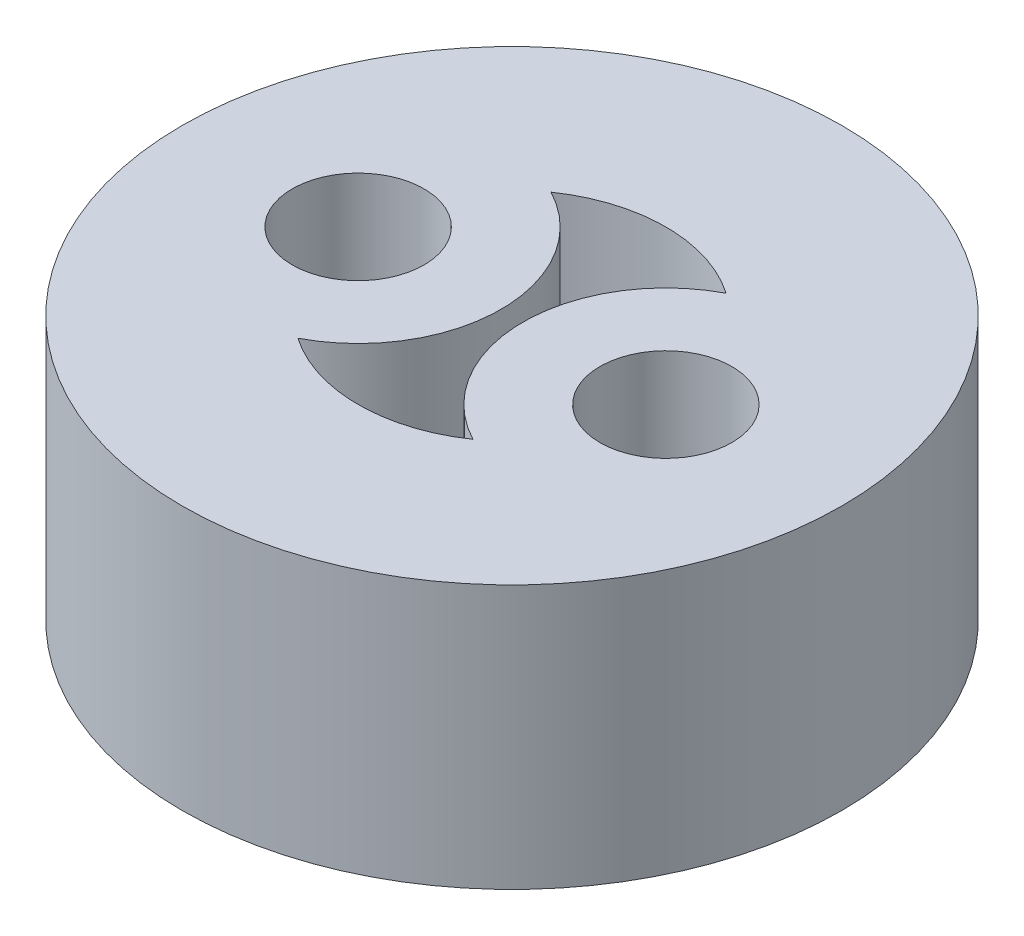
ISO-10303-21;
HEADER;
FILE_DESCRIPTION(('STEP AP214'),'2;1');
FILE_NAME('part.step','',(''),(''),'','','');
FILE_SCHEMA(('AUTOMOTIVE_DESIGN { 1 0 10303 214 1 1 1 1 }'));
ENDSEC;
DATA;
#1=APPLICATION_CONTEXT('core data for automotive mechanical design processes');
#2=APPLICATION_PROTOCOL_DEFINITION('international standard','automotive_design',2000,#1);
#3=PRODUCT_CONTEXT('',#1,'mechanical');
#4=PRODUCT('Part','Part','',(#3));
#5=PRODUCT_RELATED_PRODUCT_CATEGORY('part','',(#4));
#6=PRODUCT_DEFINITION_FORMATION('','',#4);
#7=PRODUCT_DEFINITION_CONTEXT('part definition',#1,'design');
#8=PRODUCT_DEFINITION('design','',#6,#7);
#9=PRODUCT_DEFINITION_SHAPE('','',#8);
#10=(LENGTH_UNIT() NAMED_UNIT(*) SI_UNIT(.MILLI.,.METRE.));
#11=(NAMED_UNIT(*) PLANE_ANGLE_UNIT() SI_UNIT($,.RADIAN.));
#12=(NAMED_UNIT(*) SI_UNIT($,.STERADIAN.) SOLID_ANGLE_UNIT());
#13=UNCERTAINTY_MEASURE_WITH_UNIT(LENGTH_MEASURE(1.E-05),#10,'distance_accuracy_value','');
#14=(GEOMETRIC_REPRESENTATION_CONTEXT(3) GLOBAL_UNCERTAINTY_ASSIGNED_CONTEXT((#13)) GLOBAL_UNIT_ASSIGNED_CONTEXT((#10,
#11,#12)) REPRESENTATION_CONTEXT('',''));
#15=CARTESIAN_POINT('',(0.,0.,0.));
#16=DIRECTION('',(0.,0.,1.));
#17=DIRECTION('',(1.,0.,0.));
#18=AXIS2_PLACEMENT_3D('',#15,#16,#17);
#19=CARTESIAN_POINT('',(0.,6.,0.));
#20=DIRECTION('',(0.,1.,0.));
#21=DIRECTION('',(0.,0.,1.));
#22=AXIS2_PLACEMENT_3D('',#19,#20,#21);
#23=PLANE('',#22);
#24=CARTESIAN_POINT('',(-3.5,6.,0.));
#25=DIRECTION('',(0.,1.,0.));
#26=DIRECTION('',(0.,0.,1.));
#27=AXIS2_PLACEMENT_3D('',#24,#25,#26);
#28=CIRCLE('',#27,1.5);
#29=CARTESIAN_POINT('',(-3.5,6.,1.5));
#30=VERTEX_POINT('',#29);
#31=EDGE_CURVE('E115',#30,#30,#28,.T.);
#32=ORIENTED_EDGE('',*,*,#31,.F.);
#33=EDGE_LOOP('',(#32));
#34=FACE_BOUND('',#33,.T.);
#35=CARTESIAN_POINT('',(0.,6.,0.));
#36=DIRECTION('',(0.,1.,0.));
#37=DIRECTION('',(0.,0.,1.));
#38=AXIS2_PLACEMENT_3D('',#35,#36,#37);
#39=CIRCLE('',#38,7.5);
#40=CARTESIAN_POINT('',(0.,6.,7.5));
#41=VERTEX_POINT('',#40);
#42=EDGE_CURVE('E11',#41,#41,#39,.T.);
#43=ORIENTED_EDGE('',*,*,#42,.T.);
#44=EDGE_LOOP('',(#43));
#45=FACE_BOUND('',#44,.T.);
#46=CARTESIAN_POINT('',(3.5,6.,0.));
#47=DIRECTION('',(0.,1.,0.));
#48=DIRECTION('',(0.,0.,1.));
#49=AXIS2_PLACEMENT_3D('',#46,#47,#48);
#50=CIRCLE('',#49,1.5);
#51=CARTESIAN_POINT('',(3.5,6.,1.5));
#52=VERTEX_POINT('',#51);
#53=EDGE_CURVE('E109',#52,#52,#50,.T.);
#54=ORIENTED_EDGE('',*,*,#53,.F.);
#55=EDGE_LOOP('',(#54));
#56=FACE_BOUND('',#55,.T.);
#57=CARTESIAN_POINT('',(-3.5,6.,0.));
#58=DIRECTION('',(0.,-1.,0.));
#59=DIRECTION('',(0.,0.,1.));
#60=AXIS2_PLACEMENT_3D('',#57,#58,#59);
#61=CIRCLE('',#60,3.25);
#62=CARTESIAN_POINT('',(-1.99107142857143,6.,-2.87847782105865));
#63=VERTEX_POINT('',#62);
#64=CARTESIAN_POINT('',(-1.99107142857143,6.,2.87847782105865));
#65=VERTEX_POINT('',#64);
#66=EDGE_CURVE('E81',#63,#65,#61,.T.);
#67=ORIENTED_EDGE('',*,*,#66,.F.);
#68=CARTESIAN_POINT('',(0.,6.,0.));
#69=DIRECTION('',(0.,1.,0.));
#70=DIRECTION('',(0.,0.,1.));
#71=AXIS2_PLACEMENT_3D('',#68,#69,#70);
#72=CIRCLE('',#71,3.5);
#73=CARTESIAN_POINT('',(1.99107142857143,6.,-2.87847782105865));
#74=VERTEX_POINT('',#73);
#75=EDGE_CURVE('E73',#74,#63,#72,.T.);
#76=ORIENTED_EDGE('',*,*,#75,.F.);
#77=CARTESIAN_POINT('',(3.5,6.,0.));
#78=DIRECTION('',(0.,-1.,0.));
#79=DIRECTION('',(0.,0.,1.));
#80=AXIS2_PLACEMENT_3D('',#77,#78,#79);
#81=CIRCLE('',#80,3.25);
#82=CARTESIAN_POINT('',(1.99107142857143,6.,2.87847782105865));
#83=VERTEX_POINT('',#82);
#84=EDGE_CURVE('E95',#83,#74,#81,.T.);
#85=ORIENTED_EDGE('',*,*,#84,.F.);
#86=CARTESIAN_POINT('',(0.,6.,0.));
#87=DIRECTION('',(0.,1.,0.));
#88=DIRECTION('',(0.,0.,1.));
#89=AXIS2_PLACEMENT_3D('',#86,#87,#88);
#90=CIRCLE('',#89,3.5);
#91=EDGE_CURVE('E93',#65,#83,#90,.T.);
#92=ORIENTED_EDGE('',*,*,#91,.F.);
#93=EDGE_LOOP('',(#67,#76,#85,#92));
#94=FACE_BOUND('',#93,.T.);
#95=ADVANCED_FACE('F32',(#34,#45,#56,#94),#23,.T.);
#96=CARTESIAN_POINT('',(0.,0.,0.));
#97=DIRECTION('',(0.,1.,0.));
#98=DIRECTION('',(0.,0.,1.));
#99=AXIS2_PLACEMENT_3D('',#96,#97,#98);
#100=PLANE('',#99);
#101=CARTESIAN_POINT('',(3.5,0.,0.));
#102=DIRECTION('',(0.,1.,0.));
#103=DIRECTION('',(0.,0.,1.));
#104=AXIS2_PLACEMENT_3D('',#101,#102,#103);
#105=CIRCLE('',#104,1.5);
#106=CARTESIAN_POINT('',(3.5,0.,1.5));
#107=VERTEX_POINT('',#106);
#108=EDGE_CURVE('E89',#107,#107,#105,.T.);
#109=ORIENTED_EDGE('',*,*,#108,.T.);
#110=EDGE_LOOP('',(#109));
#111=FACE_BOUND('',#110,.T.);
#112=CARTESIAN_POINT('',(-3.5,0.,0.));
#113=DIRECTION('',(0.,1.,0.));
#114=DIRECTION('',(0.,0.,1.));
#115=AXIS2_PLACEMENT_3D('',#112,#113,#114);
#116=CIRCLE('',#115,1.5);
#117=CARTESIAN_POINT('',(-3.5,0.,1.5));
#118=VERTEX_POINT('',#117);
#119=EDGE_CURVE('E112',#118,#118,#116,.T.);
#120=ORIENTED_EDGE('',*,*,#119,.T.);
#121=EDGE_LOOP('',(#120));
#122=FACE_BOUND('',#121,.T.);
#123=CARTESIAN_POINT('',(0.,0.,0.));
#124=DIRECTION('',(0.,1.,0.));
#125=DIRECTION('',(0.,0.,1.));
#126=AXIS2_PLACEMENT_3D('',#123,#124,#125);
#127=CIRCLE('',#126,7.5);
#128=CARTESIAN_POINT('',(0.,0.,7.5));
#129=VERTEX_POINT('',#128);
#130=EDGE_CURVE('E36',#129,#129,#127,.T.);
#131=ORIENTED_EDGE('',*,*,#130,.F.);
#132=EDGE_LOOP('',(#131));
#133=FACE_BOUND('',#132,.T.);
#134=CARTESIAN_POINT('',(0.,0.,0.));
#135=DIRECTION('',(0.,1.,0.));
#136=DIRECTION('',(0.,0.,1.));
#137=AXIS2_PLACEMENT_3D('',#134,#135,#136);
#138=CIRCLE('',#137,3.5);
#139=CARTESIAN_POINT('',(1.99107142857143,0.,-2.87847782105865));
#140=VERTEX_POINT('',#139);
#141=CARTESIAN_POINT('',(-1.99107142857143,0.,-2.87847782105865));
#142=VERTEX_POINT('',#141);
#143=EDGE_CURVE('E55',#140,#142,#138,.T.);
#144=ORIENTED_EDGE('',*,*,#143,.T.);
#145=CARTESIAN_POINT('',(-3.5,0.,0.));
#146=DIRECTION('',(0.,-1.,0.));
#147=DIRECTION('',(0.,0.,1.));
#148=AXIS2_PLACEMENT_3D('',#145,#146,#147);
#149=CIRCLE('',#148,3.25);
#150=CARTESIAN_POINT('',(-1.99107142857143,0.,2.87847782105865));
#151=VERTEX_POINT('',#150);
#152=EDGE_CURVE('E88',#142,#151,#149,.T.);
#153=ORIENTED_EDGE('',*,*,#152,.T.);
#154=CARTESIAN_POINT('',(0.,0.,0.));
#155=DIRECTION('',(0.,1.,0.));
#156=DIRECTION('',(0.,0.,1.));
#157=AXIS2_PLACEMENT_3D('',#154,#155,#156);
#158=CIRCLE('',#157,3.5);
#159=CARTESIAN_POINT('',(1.99107142857143,0.,2.87847782105865));
#160=VERTEX_POINT('',#159);
#161=EDGE_CURVE('E101',#151,#160,#158,.T.);
#162=ORIENTED_EDGE('',*,*,#161,.T.);
#163=CARTESIAN_POINT('',(3.5,0.,0.));
#164=DIRECTION('',(0.,-1.,0.));
#165=DIRECTION('',(0.,0.,1.));
#166=AXIS2_PLACEMENT_3D('',#163,#164,#165);
#167=CIRCLE('',#166,3.25);
#168=EDGE_CURVE('E82',#160,#140,#167,.T.);
#169=ORIENTED_EDGE('',*,*,#168,.T.);
#170=EDGE_LOOP('',(#144,#153,#162,#169));
#171=FACE_BOUND('',#170,.T.);
#172=ADVANCED_FACE('F121',(#111,#122,#133,#171),#100,.F.);
#173=CARTESIAN_POINT('',(0.,6.,0.));
#174=DIRECTION('',(0.,-1.,0.));
#175=DIRECTION('',(0.,0.,-1.));
#176=AXIS2_PLACEMENT_3D('',#173,#174,#175);
#177=CYLINDRICAL_SURFACE('',#176,7.5);
#178=ORIENTED_EDGE('',*,*,#42,.F.);
#179=EDGE_LOOP('',(#178));
#180=FACE_BOUND('',#179,.T.);
#181=ORIENTED_EDGE('',*,*,#130,.T.);
#182=EDGE_LOOP('',(#181));
#183=FACE_BOUND('',#182,.T.);
#184=ADVANCED_FACE('F34',(#180,#183),#177,.T.);
#185=CARTESIAN_POINT('',(-3.5,6.,0.));
#186=DIRECTION('',(0.,-1.,0.));
#187=DIRECTION('',(0.,0.,-1.));
#188=AXIS2_PLACEMENT_3D('',#185,#186,#187);
#189=CYLINDRICAL_SURFACE('',#188,1.5);
#190=ORIENTED_EDGE('',*,*,#31,.T.);
#191=EDGE_LOOP('',(#190));
#192=FACE_BOUND('',#191,.T.);
#193=ORIENTED_EDGE('',*,*,#119,.F.);
#194=EDGE_LOOP('',(#193));
#195=FACE_BOUND('',#194,.T.);
#196=ADVANCED_FACE('F124',(#192,#195),#189,.F.);
#197=CARTESIAN_POINT('',(3.5,6.,0.));
#198=DIRECTION('',(0.,-1.,0.));
#199=DIRECTION('',(0.,0.,-1.));
#200=AXIS2_PLACEMENT_3D('',#197,#198,#199);
#201=CYLINDRICAL_SURFACE('',#200,1.5);
#202=ORIENTED_EDGE('',*,*,#53,.T.);
#203=EDGE_LOOP('',(#202));
#204=FACE_BOUND('',#203,.T.);
#205=ORIENTED_EDGE('',*,*,#108,.F.);
#206=EDGE_LOOP('',(#205));
#207=FACE_BOUND('',#206,.T.);
#208=ADVANCED_FACE('F126',(#204,#207),#201,.F.);
#209=CARTESIAN_POINT('',(0.,6.,0.));
#210=DIRECTION('',(0.,-1.,0.));
#211=DIRECTION('',(0.,0.,-1.));
#212=AXIS2_PLACEMENT_3D('',#209,#210,#211);
#213=CYLINDRICAL_SURFACE('',#212,3.5);
#214=ORIENTED_EDGE('',*,*,#143,.F.);
#215=DIRECTION('',(0.,-1.,0.));
#216=VECTOR('',#215,1.);
#217=CARTESIAN_POINT('',(1.99107142857143,6.,-2.87847782105865));
#218=LINE('',#217,#216);
#219=EDGE_CURVE('E77',#74,#140,#218,.T.);
#220=ORIENTED_EDGE('',*,*,#219,.F.);
#221=ORIENTED_EDGE('',*,*,#75,.T.);
#222=DIRECTION('',(0.,-1.,0.));
#223=VECTOR('',#222,1.);
#224=CARTESIAN_POINT('',(-1.99107142857143,6.,-2.87847782105865));
#225=LINE('',#224,#223);
#226=EDGE_CURVE('E76',#63,#142,#225,.T.);
#227=ORIENTED_EDGE('',*,*,#226,.T.);
#228=EDGE_LOOP('',(#214,#220,#221,#227));
#229=FACE_BOUND('',#228,.T.);
#230=ADVANCED_FACE('F75',(#229),#213,.F.);
#231=CARTESIAN_POINT('',(-3.5,6.,0.));
#232=DIRECTION('',(0.,-1.,0.));
#233=DIRECTION('',(0.,0.,-1.));
#234=AXIS2_PLACEMENT_3D('',#231,#232,#233);
#235=CYLINDRICAL_SURFACE('',#234,3.25);
#236=ORIENTED_EDGE('',*,*,#152,.F.);
#237=ORIENTED_EDGE('',*,*,#226,.F.);
#238=ORIENTED_EDGE('',*,*,#66,.T.);
#239=DIRECTION('',(0.,-1.,0.));
#240=VECTOR('',#239,1.);
#241=CARTESIAN_POINT('',(-1.99107142857143,6.,2.87847782105865));
#242=LINE('',#241,#240);
#243=EDGE_CURVE('E90',#65,#151,#242,.T.);
#244=ORIENTED_EDGE('',*,*,#243,.T.);
#245=EDGE_LOOP('',(#236,#237,#238,#244));
#246=FACE_BOUND('',#245,.T.);
#247=ADVANCED_FACE('F85',(#246),#235,.T.);
#248=CARTESIAN_POINT('',(0.,6.,0.));
#249=DIRECTION('',(0.,-1.,0.));
#250=DIRECTION('',(0.,0.,-1.));
#251=AXIS2_PLACEMENT_3D('',#248,#249,#250);
#252=CYLINDRICAL_SURFACE('',#251,3.5);
#253=ORIENTED_EDGE('',*,*,#161,.F.);
#254=ORIENTED_EDGE('',*,*,#243,.F.);
#255=ORIENTED_EDGE('',*,*,#91,.T.);
#256=DIRECTION('',(0.,-1.,0.));
#257=VECTOR('',#256,1.);
#258=CARTESIAN_POINT('',(1.99107142857143,6.,2.87847782105865));
#259=LINE('',#258,#257);
#260=EDGE_CURVE('E47',#83,#160,#259,.T.);
#261=ORIENTED_EDGE('',*,*,#260,.T.);
#262=EDGE_LOOP('',(#253,#254,#255,#261));
#263=FACE_BOUND('',#262,.T.);
#264=ADVANCED_FACE('F157',(#263),#252,.F.);
#265=CARTESIAN_POINT('',(3.5,6.,0.));
#266=DIRECTION('',(0.,-1.,0.));
#267=DIRECTION('',(0.,0.,-1.));
#268=AXIS2_PLACEMENT_3D('',#265,#266,#267);
#269=CYLINDRICAL_SURFACE('',#268,3.25);
#270=ORIENTED_EDGE('',*,*,#168,.F.);
#271=ORIENTED_EDGE('',*,*,#260,.F.);
#272=ORIENTED_EDGE('',*,*,#84,.T.);
#273=ORIENTED_EDGE('',*,*,#219,.T.);
#274=EDGE_LOOP('',(#270,#271,#272,#273));
#275=FACE_BOUND('',#274,.T.);
#276=ADVANCED_FACE('F155',(#275),#269,.T.);
#277=CLOSED_SHELL('',(#95,#172,#184,#196,#208,#230,#247,#264,#276));
#278=MANIFOLD_SOLID_BREP('B2',#277);
#279=ADVANCED_BREP_SHAPE_REPRESENTATION('',(#18,#278),#14);
#280=SHAPE_DEFINITION_REPRESENTATION(#9,#279);
ENDSEC;
END-ISO-10303-21;
